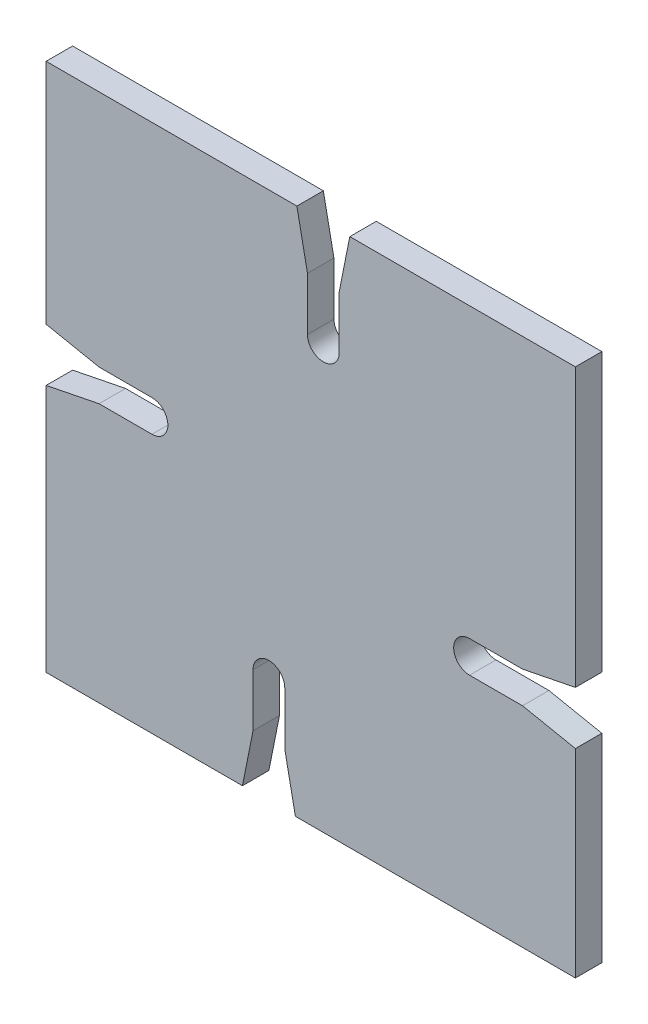
ISO-10303-21;
HEADER;
FILE_DESCRIPTION(('STEP AP214'),'2;1');
FILE_NAME('part.step','',(''),(''),'','','');
FILE_SCHEMA(('AUTOMOTIVE_DESIGN { 1 0 10303 214 1 1 1 1 }'));
ENDSEC;
DATA;
#1=APPLICATION_CONTEXT('core data for automotive mechanical design processes');
#2=APPLICATION_PROTOCOL_DEFINITION('international standard','automotive_design',2000,#1);
#3=PRODUCT_CONTEXT('',#1,'mechanical');
#4=PRODUCT('Part','Part','',(#3));
#5=PRODUCT_RELATED_PRODUCT_CATEGORY('part','',(#4));
#6=PRODUCT_DEFINITION_FORMATION('','',#4);
#7=PRODUCT_DEFINITION_CONTEXT('part definition',#1,'design');
#8=PRODUCT_DEFINITION('design','',#6,#7);
#9=PRODUCT_DEFINITION_SHAPE('','',#8);
#10=(LENGTH_UNIT() NAMED_UNIT(*) SI_UNIT(.MILLI.,.METRE.));
#11=(NAMED_UNIT(*) PLANE_ANGLE_UNIT() SI_UNIT($,.RADIAN.));
#12=(NAMED_UNIT(*) SI_UNIT($,.STERADIAN.) SOLID_ANGLE_UNIT());
#13=UNCERTAINTY_MEASURE_WITH_UNIT(LENGTH_MEASURE(1.E-05),#10,'distance_accuracy_value','');
#14=(GEOMETRIC_REPRESENTATION_CONTEXT(3) GLOBAL_UNCERTAINTY_ASSIGNED_CONTEXT((#13)) GLOBAL_UNIT_ASSIGNED_CONTEXT((#10,
#11,#12)) REPRESENTATION_CONTEXT('',''));
#15=CARTESIAN_POINT('',(0.,0.,0.));
#16=DIRECTION('',(0.,0.,1.));
#17=DIRECTION('',(1.,0.,0.));
#18=AXIS2_PLACEMENT_3D('',#15,#16,#17);
#19=CARTESIAN_POINT('',(100.,0.,5.));
#20=DIRECTION('',(-1.,0.,0.));
#21=DIRECTION('',(0.,0.,1.));
#22=AXIS2_PLACEMENT_3D('',#19,#20,#21);
#23=PLANE('',#22);
#24=DIRECTION('',(0.,1.,0.));
#25=VECTOR('',#24,1.);
#26=CARTESIAN_POINT('',(100.,0.,0.));
#27=LINE('',#26,#25);
#28=CARTESIAN_POINT('',(100.,0.,0.));
#29=VERTEX_POINT('',#28);
#30=CARTESIAN_POINT('',(100.,37.5450513889868,0.));
#31=VERTEX_POINT('',#30);
#32=EDGE_CURVE('E240',#29,#31,#27,.T.);
#33=ORIENTED_EDGE('',*,*,#32,.T.);
#34=DIRECTION('',(0.,0.,1.));
#35=VECTOR('',#34,1.);
#36=CARTESIAN_POINT('',(100.,37.5450513889868,-0.00100000000000013));
#37=LINE('',#36,#35);
#38=CARTESIAN_POINT('',(100.,37.5450513889868,5.));
#39=VERTEX_POINT('',#38);
#40=EDGE_CURVE('E221',#31,#39,#37,.T.);
#41=ORIENTED_EDGE('',*,*,#40,.T.);
#42=DIRECTION('',(0.,1.,0.));
#43=VECTOR('',#42,1.);
#44=CARTESIAN_POINT('',(100.,0.,5.));
#45=LINE('',#44,#43);
#46=CARTESIAN_POINT('',(100.,0.,5.));
#47=VERTEX_POINT('',#46);
#48=EDGE_CURVE('E407',#47,#39,#45,.T.);
#49=ORIENTED_EDGE('',*,*,#48,.F.);
#50=DIRECTION('',(0.,0.,-1.));
#51=VECTOR('',#50,1.);
#52=CARTESIAN_POINT('',(100.,0.,5.));
#53=LINE('',#52,#51);
#54=EDGE_CURVE('E45',#47,#29,#53,.T.);
#55=ORIENTED_EDGE('',*,*,#54,.T.);
#56=EDGE_LOOP('',(#33,#41,#49,#55));
#57=FACE_BOUND('',#56,.T.);
#58=ADVANCED_FACE('F37',(#57),#23,.F.);
#59=CARTESIAN_POINT('',(0.,100.,5.));
#60=DIRECTION('',(0.,-1.,0.));
#61=DIRECTION('',(0.,0.,-1.));
#62=AXIS2_PLACEMENT_3D('',#59,#60,#61);
#63=PLANE('',#62);
#64=DIRECTION('',(-1.,0.,0.));
#65=VECTOR('',#64,1.);
#66=CARTESIAN_POINT('',(0.,100.,0.));
#67=LINE('',#66,#65);
#68=CARTESIAN_POINT('',(100.,100.,0.));
#69=VERTEX_POINT('',#68);
#70=CARTESIAN_POINT('',(57.3775419070398,100.,0.));
#71=VERTEX_POINT('',#70);
#72=EDGE_CURVE('E250',#69,#71,#67,.T.);
#73=ORIENTED_EDGE('',*,*,#72,.T.);
#74=DIRECTION('',(0.,0.,1.));
#75=VECTOR('',#74,1.);
#76=CARTESIAN_POINT('',(57.3775419070398,100.,-0.00100000000000013));
#77=LINE('',#76,#75);
#78=CARTESIAN_POINT('',(57.3775419070398,100.,5.));
#79=VERTEX_POINT('',#78);
#80=EDGE_CURVE('E301',#71,#79,#77,.T.);
#81=ORIENTED_EDGE('',*,*,#80,.T.);
#82=DIRECTION('',(-1.,0.,0.));
#83=VECTOR('',#82,1.);
#84=CARTESIAN_POINT('',(0.,100.,5.));
#85=LINE('',#84,#83);
#86=CARTESIAN_POINT('',(100.,100.,5.));
#87=VERTEX_POINT('',#86);
#88=EDGE_CURVE('E262',#87,#79,#85,.T.);
#89=ORIENTED_EDGE('',*,*,#88,.F.);
#90=DIRECTION('',(0.,0.,-1.));
#91=VECTOR('',#90,1.);
#92=CARTESIAN_POINT('',(100.,100.,5.));
#93=LINE('',#92,#91);
#94=EDGE_CURVE('E261',#87,#69,#93,.T.);
#95=ORIENTED_EDGE('',*,*,#94,.T.);
#96=EDGE_LOOP('',(#73,#81,#89,#95));
#97=FACE_BOUND('',#96,.T.);
#98=ADVANCED_FACE('F268',(#97),#63,.F.);
#99=CARTESIAN_POINT('',(0.,0.,5.));
#100=DIRECTION('',(1.,0.,0.));
#101=DIRECTION('',(0.,0.,-1.));
#102=AXIS2_PLACEMENT_3D('',#99,#100,#101);
#103=PLANE('',#102);
#104=DIRECTION('',(0.,-1.,0.));
#105=VECTOR('',#104,1.);
#106=CARTESIAN_POINT('',(0.,0.,0.));
#107=LINE('',#106,#105);
#108=CARTESIAN_POINT('',(0.,100.,0.));
#109=VERTEX_POINT('',#108);
#110=CARTESIAN_POINT('',(0.,56.9667430656987,0.));
#111=VERTEX_POINT('',#110);
#112=EDGE_CURVE('E410',#109,#111,#107,.T.);
#113=ORIENTED_EDGE('',*,*,#112,.T.);
#114=DIRECTION('',(0.,0.,1.));
#115=VECTOR('',#114,1.);
#116=CARTESIAN_POINT('',(0.,56.9667430656987,-0.00100000000000013));
#117=LINE('',#116,#115);
#118=CARTESIAN_POINT('',(0.,56.9667430656987,5.));
#119=VERTEX_POINT('',#118);
#120=EDGE_CURVE('E341',#111,#119,#117,.T.);
#121=ORIENTED_EDGE('',*,*,#120,.T.);
#122=DIRECTION('',(0.,-1.,0.));
#123=VECTOR('',#122,1.);
#124=CARTESIAN_POINT('',(0.,0.,5.));
#125=LINE('',#124,#123);
#126=CARTESIAN_POINT('',(0.,100.,5.));
#127=VERTEX_POINT('',#126);
#128=EDGE_CURVE('E399',#127,#119,#125,.T.);
#129=ORIENTED_EDGE('',*,*,#128,.F.);
#130=DIRECTION('',(0.,0.,-1.));
#131=VECTOR('',#130,1.);
#132=CARTESIAN_POINT('',(0.,100.,5.));
#133=LINE('',#132,#131);
#134=EDGE_CURVE('E258',#127,#109,#133,.T.);
#135=ORIENTED_EDGE('',*,*,#134,.T.);
#136=EDGE_LOOP('',(#113,#121,#129,#135));
#137=FACE_BOUND('',#136,.T.);
#138=ADVANCED_FACE('F450',(#137),#103,.F.);
#139=CARTESIAN_POINT('',(0.,0.,5.));
#140=DIRECTION('',(0.,1.,0.));
#141=DIRECTION('',(0.,0.,1.));
#142=AXIS2_PLACEMENT_3D('',#139,#140,#141);
#143=PLANE('',#142);
#144=DIRECTION('',(1.,0.,0.));
#145=VECTOR('',#144,1.);
#146=CARTESIAN_POINT('',(0.,0.,0.));
#147=LINE('',#146,#145);
#148=CARTESIAN_POINT('',(0.,0.,0.));
#149=VERTEX_POINT('',#148);
#150=CARTESIAN_POINT('',(37.0907681686344,0.,0.));
#151=VERTEX_POINT('',#150);
#152=EDGE_CURVE('E252',#149,#151,#147,.T.);
#153=ORIENTED_EDGE('',*,*,#152,.T.);
#154=DIRECTION('',(0.,0.,1.));
#155=VECTOR('',#154,1.);
#156=CARTESIAN_POINT('',(37.0907681686344,0.,-0.00100000000000013));
#157=LINE('',#156,#155);
#158=CARTESIAN_POINT('',(37.0907681686344,0.,5.));
#159=VERTEX_POINT('',#158);
#160=EDGE_CURVE('E383',#151,#159,#157,.T.);
#161=ORIENTED_EDGE('',*,*,#160,.T.);
#162=DIRECTION('',(1.,0.,0.));
#163=VECTOR('',#162,1.);
#164=CARTESIAN_POINT('',(0.,0.,5.));
#165=LINE('',#164,#163);
#166=CARTESIAN_POINT('',(0.,0.,5.));
#167=VERTEX_POINT('',#166);
#168=EDGE_CURVE('E403',#167,#159,#165,.T.);
#169=ORIENTED_EDGE('',*,*,#168,.F.);
#170=DIRECTION('',(0.,0.,-1.));
#171=VECTOR('',#170,1.);
#172=CARTESIAN_POINT('',(0.,0.,5.));
#173=LINE('',#172,#171);
#174=EDGE_CURVE('E11',#167,#149,#173,.T.);
#175=ORIENTED_EDGE('',*,*,#174,.T.);
#176=EDGE_LOOP('',(#153,#161,#169,#175));
#177=FACE_BOUND('',#176,.T.);
#178=ADVANCED_FACE('F424',(#177),#143,.F.);
#179=CARTESIAN_POINT('',(0.,46.9667430656987,5.));
#180=VERTEX_POINT('',#179);
#181=EDGE_CURVE('E257',#180,#167,#125,.T.);
#182=ORIENTED_EDGE('',*,*,#181,.F.);
#183=DIRECTION('',(0.,0.,1.));
#184=VECTOR('',#183,1.);
#185=CARTESIAN_POINT('',(0.,46.9667430656987,-0.00100000000000013));
#186=LINE('',#185,#184);
#187=CARTESIAN_POINT('',(0.,46.9667430656987,0.));
#188=VERTEX_POINT('',#187);
#189=EDGE_CURVE('E340',#188,#180,#186,.T.);
#190=ORIENTED_EDGE('',*,*,#189,.F.);
#191=EDGE_CURVE('E398',#188,#149,#107,.T.);
#192=ORIENTED_EDGE('',*,*,#191,.T.);
#193=ORIENTED_EDGE('',*,*,#174,.F.);
#194=EDGE_LOOP('',(#182,#190,#192,#193));
#195=FACE_BOUND('',#194,.T.);
#196=ADVANCED_FACE('F39',(#195),#103,.F.);
#197=CARTESIAN_POINT('',(47.0907681686344,0.,5.));
#198=VERTEX_POINT('',#197);
#199=EDGE_CURVE('E402',#198,#47,#165,.T.);
#200=ORIENTED_EDGE('',*,*,#199,.F.);
#201=DIRECTION('',(0.,0.,1.));
#202=VECTOR('',#201,1.);
#203=CARTESIAN_POINT('',(47.0907681686344,0.,-0.00100000000000013));
#204=LINE('',#203,#202);
#205=CARTESIAN_POINT('',(47.0907681686344,0.,0.));
#206=VERTEX_POINT('',#205);
#207=EDGE_CURVE('E382',#206,#198,#204,.T.);
#208=ORIENTED_EDGE('',*,*,#207,.F.);
#209=EDGE_CURVE('E412',#206,#29,#147,.T.);
#210=ORIENTED_EDGE('',*,*,#209,.T.);
#211=ORIENTED_EDGE('',*,*,#54,.F.);
#212=EDGE_LOOP('',(#200,#208,#210,#211));
#213=FACE_BOUND('',#212,.T.);
#214=ADVANCED_FACE('F509',(#213),#143,.F.);
#215=CARTESIAN_POINT('',(100.,47.5450513889868,5.));
#216=VERTEX_POINT('',#215);
#217=EDGE_CURVE('E406',#216,#87,#45,.T.);
#218=ORIENTED_EDGE('',*,*,#217,.F.);
#219=DIRECTION('',(0.,0.,1.));
#220=VECTOR('',#219,1.);
#221=CARTESIAN_POINT('',(100.,47.5450513889868,-0.00100000000000013));
#222=LINE('',#221,#220);
#223=CARTESIAN_POINT('',(100.,47.5450513889868,0.));
#224=VERTEX_POINT('',#223);
#225=EDGE_CURVE('E469',#224,#216,#222,.T.);
#226=ORIENTED_EDGE('',*,*,#225,.F.);
#227=EDGE_CURVE('E248',#224,#69,#27,.T.);
#228=ORIENTED_EDGE('',*,*,#227,.T.);
#229=ORIENTED_EDGE('',*,*,#94,.F.);
#230=EDGE_LOOP('',(#218,#226,#228,#229));
#231=FACE_BOUND('',#230,.T.);
#232=ADVANCED_FACE('F536',(#231),#23,.F.);
#233=CARTESIAN_POINT('',(47.3775419070398,100.,5.));
#234=VERTEX_POINT('',#233);
#235=EDGE_CURVE('E409',#234,#127,#85,.T.);
#236=ORIENTED_EDGE('',*,*,#235,.F.);
#237=DIRECTION('',(0.,0.,1.));
#238=VECTOR('',#237,1.);
#239=CARTESIAN_POINT('',(47.3775419070398,100.,-0.00100000000000013));
#240=LINE('',#239,#238);
#241=CARTESIAN_POINT('',(47.3775419070398,100.,0.));
#242=VERTEX_POINT('',#241);
#243=EDGE_CURVE('E300',#242,#234,#240,.T.);
#244=ORIENTED_EDGE('',*,*,#243,.F.);
#245=EDGE_CURVE('E247',#242,#109,#67,.T.);
#246=ORIENTED_EDGE('',*,*,#245,.T.);
#247=ORIENTED_EDGE('',*,*,#134,.F.);
#248=EDGE_LOOP('',(#236,#244,#246,#247));
#249=FACE_BOUND('',#248,.T.);
#250=ADVANCED_FACE('F457',(#249),#63,.F.);
#251=CARTESIAN_POINT('',(0.,0.,5.));
#252=DIRECTION('',(0.,0.,-1.));
#253=DIRECTION('',(-1.,0.,0.));
#254=AXIS2_PLACEMENT_3D('',#251,#252,#253);
#255=PLANE('',#254);
#256=ORIENTED_EDGE('',*,*,#48,.T.);
#257=DIRECTION('',(0.98058067569092,-0.196116135138184,0.));
#258=VECTOR('',#257,1.);
#259=CARTESIAN_POINT('',(100.,37.5450513889868,5.));
#260=LINE('',#259,#258);
#261=CARTESIAN_POINT('',(90.,39.5450513889868,5.));
#262=VERTEX_POINT('',#261);
#263=EDGE_CURVE('E227',#262,#39,#260,.T.);
#264=ORIENTED_EDGE('',*,*,#263,.F.);
#265=DIRECTION('',(1.,0.,0.));
#266=VECTOR('',#265,1.);
#267=CARTESIAN_POINT('',(90.,39.5450513889868,5.));
#268=LINE('',#267,#266);
#269=CARTESIAN_POINT('',(80.,39.5450513889868,5.));
#270=VERTEX_POINT('',#269);
#271=EDGE_CURVE('E478',#270,#262,#268,.T.);
#272=ORIENTED_EDGE('',*,*,#271,.F.);
#273=CARTESIAN_POINT('',(80.,42.5450513889868,5.));
#274=DIRECTION('',(0.,0.,1.));
#275=DIRECTION('',(-1.,0.,0.));
#276=AXIS2_PLACEMENT_3D('',#273,#274,#275);
#277=CIRCLE('',#276,3.);
#278=CARTESIAN_POINT('',(80.,45.5450513889868,5.));
#279=VERTEX_POINT('',#278);
#280=EDGE_CURVE('E481',#279,#270,#277,.T.);
#281=ORIENTED_EDGE('',*,*,#280,.F.);
#282=DIRECTION('',(-1.,0.,0.));
#283=VECTOR('',#282,1.);
#284=CARTESIAN_POINT('',(80.,45.5450513889868,5.));
#285=LINE('',#284,#283);
#286=CARTESIAN_POINT('',(90.,45.5450513889868,5.));
#287=VERTEX_POINT('',#286);
#288=EDGE_CURVE('E484',#287,#279,#285,.T.);
#289=ORIENTED_EDGE('',*,*,#288,.F.);
#290=DIRECTION('',(-0.98058067569092,-0.196116135138184,0.));
#291=VECTOR('',#290,1.);
#292=CARTESIAN_POINT('',(90.,45.5450513889868,5.));
#293=LINE('',#292,#291);
#294=EDGE_CURVE('E243',#216,#287,#293,.T.);
#295=ORIENTED_EDGE('',*,*,#294,.F.);
#296=ORIENTED_EDGE('',*,*,#217,.T.);
#297=ORIENTED_EDGE('',*,*,#88,.T.);
#298=DIRECTION('',(0.196116135138184,0.98058067569092,0.));
#299=VECTOR('',#298,1.);
#300=CARTESIAN_POINT('',(57.3775419070398,100.,5.));
#301=LINE('',#300,#299);
#302=CARTESIAN_POINT('',(55.3775419070398,90.,5.));
#303=VERTEX_POINT('',#302);
#304=EDGE_CURVE('E298',#303,#79,#301,.T.);
#305=ORIENTED_EDGE('',*,*,#304,.F.);
#306=DIRECTION('',(0.,1.,0.));
#307=VECTOR('',#306,1.);
#308=CARTESIAN_POINT('',(55.3775419070398,90.,5.));
#309=LINE('',#308,#307);
#310=CARTESIAN_POINT('',(55.3775419070398,80.,5.));
#311=VERTEX_POINT('',#310);
#312=EDGE_CURVE('E295',#311,#303,#309,.T.);
#313=ORIENTED_EDGE('',*,*,#312,.F.);
#314=CARTESIAN_POINT('',(52.3775419070398,80.,5.));
#315=DIRECTION('',(0.,0.,1.));
#316=DIRECTION('',(-1.,0.,0.));
#317=AXIS2_PLACEMENT_3D('',#314,#315,#316);
#318=CIRCLE('',#317,3.);
#319=CARTESIAN_POINT('',(49.3775419070398,80.,5.));
#320=VERTEX_POINT('',#319);
#321=EDGE_CURVE('E292',#320,#311,#318,.T.);
#322=ORIENTED_EDGE('',*,*,#321,.F.);
#323=DIRECTION('',(0.,-1.,0.));
#324=VECTOR('',#323,1.);
#325=CARTESIAN_POINT('',(49.3775419070398,80.,5.));
#326=LINE('',#325,#324);
#327=CARTESIAN_POINT('',(49.3775419070398,90.,5.));
#328=VERTEX_POINT('',#327);
#329=EDGE_CURVE('E284',#328,#320,#326,.T.);
#330=ORIENTED_EDGE('',*,*,#329,.F.);
#331=DIRECTION('',(0.196116135138184,-0.98058067569092,0.));
#332=VECTOR('',#331,1.);
#333=CARTESIAN_POINT('',(49.3775419070398,90.,5.));
#334=LINE('',#333,#332);
#335=EDGE_CURVE('E282',#234,#328,#334,.T.);
#336=ORIENTED_EDGE('',*,*,#335,.F.);
#337=ORIENTED_EDGE('',*,*,#235,.T.);
#338=ORIENTED_EDGE('',*,*,#128,.T.);
#339=DIRECTION('',(-0.98058067569092,0.196116135138184,0.));
#340=VECTOR('',#339,1.);
#341=CARTESIAN_POINT('',(0.,56.9667430656987,5.));
#342=LINE('',#341,#340);
#343=CARTESIAN_POINT('',(10.,54.9667430656987,5.));
#344=VERTEX_POINT('',#343);
#345=EDGE_CURVE('E338',#344,#119,#342,.T.);
#346=ORIENTED_EDGE('',*,*,#345,.F.);
#347=DIRECTION('',(-1.,0.,0.));
#348=VECTOR('',#347,1.);
#349=CARTESIAN_POINT('',(10.,54.9667430656987,5.));
#350=LINE('',#349,#348);
#351=CARTESIAN_POINT('',(20.,54.9667430656987,5.));
#352=VERTEX_POINT('',#351);
#353=EDGE_CURVE('E335',#352,#344,#350,.T.);
#354=ORIENTED_EDGE('',*,*,#353,.F.);
#355=CARTESIAN_POINT('',(20.,51.9667430656987,5.));
#356=DIRECTION('',(0.,0.,1.));
#357=DIRECTION('',(-1.,0.,0.));
#358=AXIS2_PLACEMENT_3D('',#355,#356,#357);
#359=CIRCLE('',#358,3.);
#360=CARTESIAN_POINT('',(20.,48.9667430656987,5.));
#361=VERTEX_POINT('',#360);
#362=EDGE_CURVE('E332',#361,#352,#359,.T.);
#363=ORIENTED_EDGE('',*,*,#362,.F.);
#364=DIRECTION('',(1.,0.,0.));
#365=VECTOR('',#364,1.);
#366=CARTESIAN_POINT('',(20.,48.9667430656987,5.));
#367=LINE('',#366,#365);
#368=CARTESIAN_POINT('',(10.,48.9667430656987,5.));
#369=VERTEX_POINT('',#368);
#370=EDGE_CURVE('E329',#369,#361,#367,.T.);
#371=ORIENTED_EDGE('',*,*,#370,.F.);
#372=DIRECTION('',(0.98058067569092,0.196116135138185,0.));
#373=VECTOR('',#372,1.);
#374=CARTESIAN_POINT('',(10.,48.9667430656987,5.));
#375=LINE('',#374,#373);
#376=EDGE_CURVE('E326',#180,#369,#375,.T.);
#377=ORIENTED_EDGE('',*,*,#376,.F.);
#378=ORIENTED_EDGE('',*,*,#181,.T.);
#379=ORIENTED_EDGE('',*,*,#168,.T.);
#380=DIRECTION('',(-0.196116135138184,-0.98058067569092,0.));
#381=VECTOR('',#380,1.);
#382=CARTESIAN_POINT('',(37.0907681686344,0.,5.));
#383=LINE('',#382,#381);
#384=CARTESIAN_POINT('',(39.0907681686344,10.,5.));
#385=VERTEX_POINT('',#384);
#386=EDGE_CURVE('E380',#385,#159,#383,.T.);
#387=ORIENTED_EDGE('',*,*,#386,.F.);
#388=DIRECTION('',(0.,-1.,0.));
#389=VECTOR('',#388,1.);
#390=CARTESIAN_POINT('',(39.0907681686344,10.,5.));
#391=LINE('',#390,#389);
#392=CARTESIAN_POINT('',(39.0907681686344,20.,5.));
#393=VERTEX_POINT('',#392);
#394=EDGE_CURVE('E377',#393,#385,#391,.T.);
#395=ORIENTED_EDGE('',*,*,#394,.F.);
#396=CARTESIAN_POINT('',(42.0907681686344,20.,5.));
#397=DIRECTION('',(0.,0.,1.));
#398=DIRECTION('',(-1.,0.,0.));
#399=AXIS2_PLACEMENT_3D('',#396,#397,#398);
#400=CIRCLE('',#399,3.);
#401=CARTESIAN_POINT('',(45.0907681686344,20.,5.));
#402=VERTEX_POINT('',#401);
#403=EDGE_CURVE('E374',#402,#393,#400,.T.);
#404=ORIENTED_EDGE('',*,*,#403,.F.);
#405=DIRECTION('',(0.,1.,0.));
#406=VECTOR('',#405,1.);
#407=CARTESIAN_POINT('',(45.0907681686344,20.,5.));
#408=LINE('',#407,#406);
#409=CARTESIAN_POINT('',(45.0907681686344,10.,5.));
#410=VERTEX_POINT('',#409);
#411=EDGE_CURVE('E371',#410,#402,#408,.T.);
#412=ORIENTED_EDGE('',*,*,#411,.F.);
#413=DIRECTION('',(-0.196116135138185,0.98058067569092,0.));
#414=VECTOR('',#413,1.);
#415=CARTESIAN_POINT('',(45.0907681686344,10.,5.));
#416=LINE('',#415,#414);
#417=EDGE_CURVE('E368',#198,#410,#416,.T.);
#418=ORIENTED_EDGE('',*,*,#417,.F.);
#419=ORIENTED_EDGE('',*,*,#199,.T.);
#420=EDGE_LOOP('',(#256,#264,#272,#281,#289,#295,#296,#297,#305,#313,#322,#330,#336,#337,#338,
#346,#354,#363,#371,#377,#378,#379,#387,#395,#404,#412,#418,#419));
#421=FACE_BOUND('',#420,.T.);
#422=ADVANCED_FACE('F427',(#421),#255,.F.);
#423=CARTESIAN_POINT('',(0.,0.,0.));
#424=DIRECTION('',(0.,0.,-1.));
#425=DIRECTION('',(-1.,0.,0.));
#426=AXIS2_PLACEMENT_3D('',#423,#424,#425);
#427=PLANE('',#426);
#428=DIRECTION('',(0.98058067569092,-0.196116135138184,0.));
#429=VECTOR('',#428,1.);
#430=CARTESIAN_POINT('',(100.,37.5450513889868,0.));
#431=LINE('',#430,#429);
#432=CARTESIAN_POINT('',(90.,39.5450513889868,0.));
#433=VERTEX_POINT('',#432);
#434=EDGE_CURVE('E224',#433,#31,#431,.T.);
#435=ORIENTED_EDGE('',*,*,#434,.T.);
#436=ORIENTED_EDGE('',*,*,#32,.F.);
#437=ORIENTED_EDGE('',*,*,#209,.F.);
#438=DIRECTION('',(-0.196116135138185,0.98058067569092,0.));
#439=VECTOR('',#438,1.);
#440=CARTESIAN_POINT('',(45.0907681686344,10.,0.));
#441=LINE('',#440,#439);
#442=CARTESIAN_POINT('',(45.0907681686344,10.,0.));
#443=VERTEX_POINT('',#442);
#444=EDGE_CURVE('E386',#206,#443,#441,.T.);
#445=ORIENTED_EDGE('',*,*,#444,.T.);
#446=DIRECTION('',(0.,1.,0.));
#447=VECTOR('',#446,1.);
#448=CARTESIAN_POINT('',(45.0907681686344,20.,0.));
#449=LINE('',#448,#447);
#450=CARTESIAN_POINT('',(45.0907681686344,20.,0.));
#451=VERTEX_POINT('',#450);
#452=EDGE_CURVE('E356',#443,#451,#449,.T.);
#453=ORIENTED_EDGE('',*,*,#452,.T.);
#454=CARTESIAN_POINT('',(42.0907681686344,20.,0.));
#455=DIRECTION('',(0.,0.,-1.));
#456=DIRECTION('',(-1.,0.,0.));
#457=AXIS2_PLACEMENT_3D('',#454,#455,#456);
#458=CIRCLE('',#457,3.);
#459=CARTESIAN_POINT('',(39.0907681686344,20.,0.));
#460=VERTEX_POINT('',#459);
#461=EDGE_CURVE('E359',#451,#460,#458,.F.);
#462=ORIENTED_EDGE('',*,*,#461,.T.);
#463=DIRECTION('',(0.,-1.,0.));
#464=VECTOR('',#463,1.);
#465=CARTESIAN_POINT('',(39.0907681686344,10.,0.));
#466=LINE('',#465,#464);
#467=CARTESIAN_POINT('',(39.0907681686344,10.,0.));
#468=VERTEX_POINT('',#467);
#469=EDGE_CURVE('E362',#460,#468,#466,.T.);
#470=ORIENTED_EDGE('',*,*,#469,.T.);
#471=DIRECTION('',(-0.196116135138184,-0.98058067569092,0.));
#472=VECTOR('',#471,1.);
#473=CARTESIAN_POINT('',(37.0907681686344,0.,0.));
#474=LINE('',#473,#472);
#475=EDGE_CURVE('E365',#468,#151,#474,.T.);
#476=ORIENTED_EDGE('',*,*,#475,.T.);
#477=ORIENTED_EDGE('',*,*,#152,.F.);
#478=ORIENTED_EDGE('',*,*,#191,.F.);
#479=DIRECTION('',(0.98058067569092,0.196116135138185,0.));
#480=VECTOR('',#479,1.);
#481=CARTESIAN_POINT('',(10.,48.9667430656987,0.));
#482=LINE('',#481,#480);
#483=CARTESIAN_POINT('',(10.,48.9667430656987,0.));
#484=VERTEX_POINT('',#483);
#485=EDGE_CURVE('E344',#188,#484,#482,.T.);
#486=ORIENTED_EDGE('',*,*,#485,.T.);
#487=DIRECTION('',(1.,0.,0.));
#488=VECTOR('',#487,1.);
#489=CARTESIAN_POINT('',(20.,48.9667430656987,0.));
#490=LINE('',#489,#488);
#491=CARTESIAN_POINT('',(20.,48.9667430656987,0.));
#492=VERTEX_POINT('',#491);
#493=EDGE_CURVE('E314',#484,#492,#490,.T.);
#494=ORIENTED_EDGE('',*,*,#493,.T.);
#495=CARTESIAN_POINT('',(20.,51.9667430656987,0.));
#496=DIRECTION('',(0.,0.,-1.));
#497=DIRECTION('',(-1.,0.,0.));
#498=AXIS2_PLACEMENT_3D('',#495,#496,#497);
#499=CIRCLE('',#498,3.);
#500=CARTESIAN_POINT('',(20.,54.9667430656987,0.));
#501=VERTEX_POINT('',#500);
#502=EDGE_CURVE('E317',#492,#501,#499,.F.);
#503=ORIENTED_EDGE('',*,*,#502,.T.);
#504=DIRECTION('',(-1.,0.,0.));
#505=VECTOR('',#504,1.);
#506=CARTESIAN_POINT('',(10.,54.9667430656987,0.));
#507=LINE('',#506,#505);
#508=CARTESIAN_POINT('',(10.,54.9667430656987,0.));
#509=VERTEX_POINT('',#508);
#510=EDGE_CURVE('E320',#501,#509,#507,.T.);
#511=ORIENTED_EDGE('',*,*,#510,.T.);
#512=DIRECTION('',(-0.98058067569092,0.196116135138184,0.));
#513=VECTOR('',#512,1.);
#514=CARTESIAN_POINT('',(0.,56.9667430656987,0.));
#515=LINE('',#514,#513);
#516=EDGE_CURVE('E323',#509,#111,#515,.T.);
#517=ORIENTED_EDGE('',*,*,#516,.T.);
#518=ORIENTED_EDGE('',*,*,#112,.F.);
#519=ORIENTED_EDGE('',*,*,#245,.F.);
#520=DIRECTION('',(0.196116135138184,-0.98058067569092,0.));
#521=VECTOR('',#520,1.);
#522=CARTESIAN_POINT('',(49.3775419070398,90.,0.));
#523=LINE('',#522,#521);
#524=CARTESIAN_POINT('',(49.3775419070398,90.,0.));
#525=VERTEX_POINT('',#524);
#526=EDGE_CURVE('E303',#242,#525,#523,.T.);
#527=ORIENTED_EDGE('',*,*,#526,.T.);
#528=DIRECTION('',(0.,-1.,0.));
#529=VECTOR('',#528,1.);
#530=CARTESIAN_POINT('',(49.3775419070398,80.,0.));
#531=LINE('',#530,#529);
#532=CARTESIAN_POINT('',(49.3775419070398,80.,0.));
#533=VERTEX_POINT('',#532);
#534=EDGE_CURVE('E459',#525,#533,#531,.T.);
#535=ORIENTED_EDGE('',*,*,#534,.T.);
#536=CARTESIAN_POINT('',(52.3775419070398,80.,0.));
#537=DIRECTION('',(0.,0.,-1.));
#538=DIRECTION('',(-1.,0.,0.));
#539=AXIS2_PLACEMENT_3D('',#536,#537,#538);
#540=CIRCLE('',#539,3.);
#541=CARTESIAN_POINT('',(55.3775419070398,80.,0.));
#542=VERTEX_POINT('',#541);
#543=EDGE_CURVE('E286',#533,#542,#540,.F.);
#544=ORIENTED_EDGE('',*,*,#543,.T.);
#545=DIRECTION('',(0.,1.,0.));
#546=VECTOR('',#545,1.);
#547=CARTESIAN_POINT('',(55.3775419070398,90.,0.));
#548=LINE('',#547,#546);
#549=CARTESIAN_POINT('',(55.3775419070398,90.,0.));
#550=VERTEX_POINT('',#549);
#551=EDGE_CURVE('E279',#542,#550,#548,.T.);
#552=ORIENTED_EDGE('',*,*,#551,.T.);
#553=DIRECTION('',(0.196116135138184,0.98058067569092,0.));
#554=VECTOR('',#553,1.);
#555=CARTESIAN_POINT('',(57.3775419070398,100.,0.));
#556=LINE('',#555,#554);
#557=EDGE_CURVE('E277',#550,#71,#556,.T.);
#558=ORIENTED_EDGE('',*,*,#557,.T.);
#559=ORIENTED_EDGE('',*,*,#72,.F.);
#560=ORIENTED_EDGE('',*,*,#227,.F.);
#561=DIRECTION('',(-0.98058067569092,-0.196116135138184,0.));
#562=VECTOR('',#561,1.);
#563=CARTESIAN_POINT('',(90.,45.5450513889868,0.));
#564=LINE('',#563,#562);
#565=CARTESIAN_POINT('',(90.,45.5450513889868,0.));
#566=VERTEX_POINT('',#565);
#567=EDGE_CURVE('E232',#224,#566,#564,.T.);
#568=ORIENTED_EDGE('',*,*,#567,.T.);
#569=DIRECTION('',(-1.,0.,0.));
#570=VECTOR('',#569,1.);
#571=CARTESIAN_POINT('',(80.,45.5450513889868,0.));
#572=LINE('',#571,#570);
#573=CARTESIAN_POINT('',(80.,45.5450513889868,0.));
#574=VERTEX_POINT('',#573);
#575=EDGE_CURVE('E491',#566,#574,#572,.T.);
#576=ORIENTED_EDGE('',*,*,#575,.T.);
#577=CARTESIAN_POINT('',(80.,42.5450513889868,0.));
#578=DIRECTION('',(0.,0.,-1.));
#579=DIRECTION('',(-1.,0.,0.));
#580=AXIS2_PLACEMENT_3D('',#577,#578,#579);
#581=CIRCLE('',#580,3.);
#582=CARTESIAN_POINT('',(80.,39.5450513889868,0.));
#583=VERTEX_POINT('',#582);
#584=EDGE_CURVE('E489',#574,#583,#581,.F.);
#585=ORIENTED_EDGE('',*,*,#584,.T.);
#586=DIRECTION('',(1.,0.,0.));
#587=VECTOR('',#586,1.);
#588=CARTESIAN_POINT('',(90.,39.5450513889868,0.));
#589=LINE('',#588,#587);
#590=EDGE_CURVE('E242',#583,#433,#589,.T.);
#591=ORIENTED_EDGE('',*,*,#590,.T.);
#592=EDGE_LOOP('',(#435,#436,#437,#445,#453,#462,#470,#476,#477,#478,#486,#494,#503,#511,#517,
#518,#519,#527,#535,#544,#552,#558,#559,#560,#568,#576,#585,#591));
#593=FACE_BOUND('',#592,.T.);
#594=ADVANCED_FACE('F238',(#593),#427,.T.);
#595=CARTESIAN_POINT('',(37.0907681686344,0.,-0.00100000000000013));
#596=DIRECTION('',(-0.98058067569092,0.196116135138184,0.));
#597=DIRECTION('',(-0.196116135138184,-0.98058067569092,0.));
#598=AXIS2_PLACEMENT_3D('',#595,#596,#597);
#599=PLANE('',#598);
#600=DIRECTION('',(0.,0.,1.));
#601=VECTOR('',#600,1.);
#602=CARTESIAN_POINT('',(39.0907681686344,10.,-0.00100000000000013));
#603=LINE('',#602,#601);
#604=EDGE_CURVE('E387',#468,#385,#603,.T.);
#605=ORIENTED_EDGE('',*,*,#604,.T.);
#606=ORIENTED_EDGE('',*,*,#386,.T.);
#607=ORIENTED_EDGE('',*,*,#160,.F.);
#608=ORIENTED_EDGE('',*,*,#475,.F.);
#609=EDGE_LOOP('',(#605,#606,#607,#608));
#610=FACE_BOUND('',#609,.T.);
#611=ADVANCED_FACE('F524',(#610),#599,.F.);
#612=CARTESIAN_POINT('',(39.0907681686344,10.,-0.00100000000000013));
#613=DIRECTION('',(-1.,0.,0.));
#614=DIRECTION('',(0.,0.,1.));
#615=AXIS2_PLACEMENT_3D('',#612,#613,#614);
#616=PLANE('',#615);
#617=DIRECTION('',(0.,0.,1.));
#618=VECTOR('',#617,1.);
#619=CARTESIAN_POINT('',(39.0907681686344,20.,-0.00100000000000013));
#620=LINE('',#619,#618);
#621=EDGE_CURVE('E389',#460,#393,#620,.T.);
#622=ORIENTED_EDGE('',*,*,#621,.T.);
#623=ORIENTED_EDGE('',*,*,#394,.T.);
#624=ORIENTED_EDGE('',*,*,#604,.F.);
#625=ORIENTED_EDGE('',*,*,#469,.F.);
#626=EDGE_LOOP('',(#622,#623,#624,#625));
#627=FACE_BOUND('',#626,.T.);
#628=ADVANCED_FACE('F522',(#627),#616,.F.);
#629=CARTESIAN_POINT('',(42.0907681686344,20.,-0.00100000000000013));
#630=DIRECTION('',(0.,0.,1.));
#631=DIRECTION('',(1.,0.,0.));
#632=AXIS2_PLACEMENT_3D('',#629,#630,#631);
#633=CYLINDRICAL_SURFACE('',#632,3.);
#634=DIRECTION('',(0.,0.,1.));
#635=VECTOR('',#634,1.);
#636=CARTESIAN_POINT('',(45.0907681686344,20.,-0.00100000000000013));
#637=LINE('',#636,#635);
#638=EDGE_CURVE('E391',#451,#402,#637,.T.);
#639=ORIENTED_EDGE('',*,*,#638,.T.);
#640=ORIENTED_EDGE('',*,*,#403,.T.);
#641=ORIENTED_EDGE('',*,*,#621,.F.);
#642=ORIENTED_EDGE('',*,*,#461,.F.);
#643=EDGE_LOOP('',(#639,#640,#641,#642));
#644=FACE_BOUND('',#643,.T.);
#645=ADVANCED_FACE('F518',(#644),#633,.F.);
#646=CARTESIAN_POINT('',(45.0907681686344,20.,-0.00100000000000013));
#647=DIRECTION('',(1.,0.,0.));
#648=DIRECTION('',(0.,0.,-1.));
#649=AXIS2_PLACEMENT_3D('',#646,#647,#648);
#650=PLANE('',#649);
#651=DIRECTION('',(0.,0.,1.));
#652=VECTOR('',#651,1.);
#653=CARTESIAN_POINT('',(45.0907681686344,10.,-0.00100000000000013));
#654=LINE('',#653,#652);
#655=EDGE_CURVE('E393',#443,#410,#654,.T.);
#656=ORIENTED_EDGE('',*,*,#655,.T.);
#657=ORIENTED_EDGE('',*,*,#411,.T.);
#658=ORIENTED_EDGE('',*,*,#638,.F.);
#659=ORIENTED_EDGE('',*,*,#452,.F.);
#660=EDGE_LOOP('',(#656,#657,#658,#659));
#661=FACE_BOUND('',#660,.T.);
#662=ADVANCED_FACE('F515',(#661),#650,.F.);
#663=CARTESIAN_POINT('',(45.0907681686344,10.,-0.00100000000000013));
#664=DIRECTION('',(0.98058067569092,0.196116135138185,0.));
#665=DIRECTION('',(-0.196116135138185,0.98058067569092,0.));
#666=AXIS2_PLACEMENT_3D('',#663,#664,#665);
#667=PLANE('',#666);
#668=ORIENTED_EDGE('',*,*,#207,.T.);
#669=ORIENTED_EDGE('',*,*,#417,.T.);
#670=ORIENTED_EDGE('',*,*,#655,.F.);
#671=ORIENTED_EDGE('',*,*,#444,.F.);
#672=EDGE_LOOP('',(#668,#669,#670,#671));
#673=FACE_BOUND('',#672,.T.);
#674=ADVANCED_FACE('F512',(#673),#667,.F.);
#675=CARTESIAN_POINT('',(0.,56.9667430656987,-0.00100000000000013));
#676=DIRECTION('',(0.196116135138184,0.98058067569092,0.));
#677=DIRECTION('',(-0.98058067569092,0.196116135138184,0.));
#678=AXIS2_PLACEMENT_3D('',#675,#676,#677);
#679=PLANE('',#678);
#680=DIRECTION('',(0.,0.,1.));
#681=VECTOR('',#680,1.);
#682=CARTESIAN_POINT('',(10.,54.9667430656987,-0.00100000000000013));
#683=LINE('',#682,#681);
#684=EDGE_CURVE('E345',#509,#344,#683,.T.);
#685=ORIENTED_EDGE('',*,*,#684,.T.);
#686=ORIENTED_EDGE('',*,*,#345,.T.);
#687=ORIENTED_EDGE('',*,*,#120,.F.);
#688=ORIENTED_EDGE('',*,*,#516,.F.);
#689=EDGE_LOOP('',(#685,#686,#687,#688));
#690=FACE_BOUND('',#689,.T.);
#691=ADVANCED_FACE('F448',(#690),#679,.F.);
#692=CARTESIAN_POINT('',(10.,54.9667430656987,-0.00100000000000013));
#693=DIRECTION('',(0.,1.,0.));
#694=DIRECTION('',(0.,0.,1.));
#695=AXIS2_PLACEMENT_3D('',#692,#693,#694);
#696=PLANE('',#695);
#697=DIRECTION('',(0.,0.,1.));
#698=VECTOR('',#697,1.);
#699=CARTESIAN_POINT('',(20.,54.9667430656987,-0.00100000000000013));
#700=LINE('',#699,#698);
#701=EDGE_CURVE('E347',#501,#352,#700,.T.);
#702=ORIENTED_EDGE('',*,*,#701,.T.);
#703=ORIENTED_EDGE('',*,*,#353,.T.);
#704=ORIENTED_EDGE('',*,*,#684,.F.);
#705=ORIENTED_EDGE('',*,*,#510,.F.);
#706=EDGE_LOOP('',(#702,#703,#704,#705));
#707=FACE_BOUND('',#706,.T.);
#708=ADVANCED_FACE('F443',(#707),#696,.F.);
#709=CARTESIAN_POINT('',(20.,51.9667430656987,-0.00100000000000013));
#710=DIRECTION('',(0.,0.,1.));
#711=DIRECTION('',(1.,0.,0.));
#712=AXIS2_PLACEMENT_3D('',#709,#710,#711);
#713=CYLINDRICAL_SURFACE('',#712,3.);
#714=DIRECTION('',(0.,0.,1.));
#715=VECTOR('',#714,1.);
#716=CARTESIAN_POINT('',(20.,48.9667430656987,-0.00100000000000013));
#717=LINE('',#716,#715);
#718=EDGE_CURVE('E349',#492,#361,#717,.T.);
#719=ORIENTED_EDGE('',*,*,#718,.T.);
#720=ORIENTED_EDGE('',*,*,#362,.T.);
#721=ORIENTED_EDGE('',*,*,#701,.F.);
#722=ORIENTED_EDGE('',*,*,#502,.F.);
#723=EDGE_LOOP('',(#719,#720,#721,#722));
#724=FACE_BOUND('',#723,.T.);
#725=ADVANCED_FACE('F439',(#724),#713,.F.);
#726=CARTESIAN_POINT('',(20.,48.9667430656987,-0.00100000000000013));
#727=DIRECTION('',(0.,-1.,0.));
#728=DIRECTION('',(0.,0.,-1.));
#729=AXIS2_PLACEMENT_3D('',#726,#727,#728);
#730=PLANE('',#729);
#731=DIRECTION('',(0.,0.,1.));
#732=VECTOR('',#731,1.);
#733=CARTESIAN_POINT('',(10.,48.9667430656987,-0.00100000000000013));
#734=LINE('',#733,#732);
#735=EDGE_CURVE('E351',#484,#369,#734,.T.);
#736=ORIENTED_EDGE('',*,*,#735,.T.);
#737=ORIENTED_EDGE('',*,*,#370,.T.);
#738=ORIENTED_EDGE('',*,*,#718,.F.);
#739=ORIENTED_EDGE('',*,*,#493,.F.);
#740=EDGE_LOOP('',(#736,#737,#738,#739));
#741=FACE_BOUND('',#740,.T.);
#742=ADVANCED_FACE('F437',(#741),#730,.F.);
#743=CARTESIAN_POINT('',(10.,48.9667430656987,-0.00100000000000013));
#744=DIRECTION('',(0.196116135138185,-0.98058067569092,0.));
#745=DIRECTION('',(0.98058067569092,0.196116135138185,0.));
#746=AXIS2_PLACEMENT_3D('',#743,#744,#745);
#747=PLANE('',#746);
#748=ORIENTED_EDGE('',*,*,#189,.T.);
#749=ORIENTED_EDGE('',*,*,#376,.T.);
#750=ORIENTED_EDGE('',*,*,#735,.F.);
#751=ORIENTED_EDGE('',*,*,#485,.F.);
#752=EDGE_LOOP('',(#748,#749,#750,#751));
#753=FACE_BOUND('',#752,.T.);
#754=ADVANCED_FACE('F433',(#753),#747,.F.);
#755=CARTESIAN_POINT('',(57.3775419070398,100.,-0.00100000000000013));
#756=DIRECTION('',(0.98058067569092,-0.196116135138184,0.));
#757=DIRECTION('',(0.196116135138184,0.98058067569092,0.));
#758=AXIS2_PLACEMENT_3D('',#755,#756,#757);
#759=PLANE('',#758);
#760=DIRECTION('',(0.,0.,1.));
#761=VECTOR('',#760,1.);
#762=CARTESIAN_POINT('',(55.3775419070398,90.,-0.00100000000000013));
#763=LINE('',#762,#761);
#764=EDGE_CURVE('E304',#550,#303,#763,.T.);
#765=ORIENTED_EDGE('',*,*,#764,.T.);
#766=ORIENTED_EDGE('',*,*,#304,.T.);
#767=ORIENTED_EDGE('',*,*,#80,.F.);
#768=ORIENTED_EDGE('',*,*,#557,.F.);
#769=EDGE_LOOP('',(#765,#766,#767,#768));
#770=FACE_BOUND('',#769,.T.);
#771=ADVANCED_FACE('F558',(#770),#759,.F.);
#772=CARTESIAN_POINT('',(55.3775419070398,90.,-0.00100000000000013));
#773=DIRECTION('',(1.,0.,0.));
#774=DIRECTION('',(0.,1.,0.));
#775=AXIS2_PLACEMENT_3D('',#772,#773,#774);
#776=PLANE('',#775);
#777=DIRECTION('',(0.,0.,1.));
#778=VECTOR('',#777,1.);
#779=CARTESIAN_POINT('',(55.3775419070398,80.,-0.00100000000000013));
#780=LINE('',#779,#778);
#781=EDGE_CURVE('E306',#542,#311,#780,.T.);
#782=ORIENTED_EDGE('',*,*,#781,.T.);
#783=ORIENTED_EDGE('',*,*,#312,.T.);
#784=ORIENTED_EDGE('',*,*,#764,.F.);
#785=ORIENTED_EDGE('',*,*,#551,.F.);
#786=EDGE_LOOP('',(#782,#783,#784,#785));
#787=FACE_BOUND('',#786,.T.);
#788=ADVANCED_FACE('F561',(#787),#776,.F.);
#789=CARTESIAN_POINT('',(52.3775419070398,80.,-0.00100000000000013));
#790=DIRECTION('',(0.,0.,1.));
#791=DIRECTION('',(1.,0.,0.));
#792=AXIS2_PLACEMENT_3D('',#789,#790,#791);
#793=CYLINDRICAL_SURFACE('',#792,3.);
#794=DIRECTION('',(0.,0.,1.));
#795=VECTOR('',#794,1.);
#796=CARTESIAN_POINT('',(49.3775419070398,80.,-0.00100000000000013));
#797=LINE('',#796,#795);
#798=EDGE_CURVE('E308',#533,#320,#797,.T.);
#799=ORIENTED_EDGE('',*,*,#798,.T.);
#800=ORIENTED_EDGE('',*,*,#321,.T.);
#801=ORIENTED_EDGE('',*,*,#781,.F.);
#802=ORIENTED_EDGE('',*,*,#543,.F.);
#803=EDGE_LOOP('',(#799,#800,#801,#802));
#804=FACE_BOUND('',#803,.T.);
#805=ADVANCED_FACE('F564',(#804),#793,.F.);
#806=CARTESIAN_POINT('',(49.3775419070398,80.,-0.00100000000000013));
#807=DIRECTION('',(-1.,0.,0.));
#808=DIRECTION('',(0.,0.,1.));
#809=AXIS2_PLACEMENT_3D('',#806,#807,#808);
#810=PLANE('',#809);
#811=DIRECTION('',(0.,0.,1.));
#812=VECTOR('',#811,1.);
#813=CARTESIAN_POINT('',(49.3775419070398,90.,-0.00100000000000013));
#814=LINE('',#813,#812);
#815=EDGE_CURVE('E60',#525,#328,#814,.T.);
#816=ORIENTED_EDGE('',*,*,#815,.T.);
#817=ORIENTED_EDGE('',*,*,#329,.T.);
#818=ORIENTED_EDGE('',*,*,#798,.F.);
#819=ORIENTED_EDGE('',*,*,#534,.F.);
#820=EDGE_LOOP('',(#816,#817,#818,#819));
#821=FACE_BOUND('',#820,.T.);
#822=ADVANCED_FACE('F465',(#821),#810,.F.);
#823=CARTESIAN_POINT('',(49.3775419070398,90.,-0.00100000000000013));
#824=DIRECTION('',(-0.98058067569092,-0.196116135138184,0.));
#825=DIRECTION('',(0.196116135138184,-0.98058067569092,0.));
#826=AXIS2_PLACEMENT_3D('',#823,#824,#825);
#827=PLANE('',#826);
#828=ORIENTED_EDGE('',*,*,#243,.T.);
#829=ORIENTED_EDGE('',*,*,#335,.T.);
#830=ORIENTED_EDGE('',*,*,#815,.F.);
#831=ORIENTED_EDGE('',*,*,#526,.F.);
#832=EDGE_LOOP('',(#828,#829,#830,#831));
#833=FACE_BOUND('',#832,.T.);
#834=ADVANCED_FACE('F460',(#833),#827,.F.);
#835=CARTESIAN_POINT('',(100.,37.5450513889868,-0.00100000000000013));
#836=DIRECTION('',(-0.196116135138184,-0.98058067569092,0.));
#837=DIRECTION('',(0.98058067569092,-0.196116135138184,0.));
#838=AXIS2_PLACEMENT_3D('',#835,#836,#837);
#839=PLANE('',#838);
#840=DIRECTION('',(0.,0.,1.));
#841=VECTOR('',#840,1.);
#842=CARTESIAN_POINT('',(90.,39.5450513889868,-0.00100000000000013));
#843=LINE('',#842,#841);
#844=EDGE_CURVE('E233',#433,#262,#843,.T.);
#845=ORIENTED_EDGE('',*,*,#844,.T.);
#846=ORIENTED_EDGE('',*,*,#263,.T.);
#847=ORIENTED_EDGE('',*,*,#40,.F.);
#848=ORIENTED_EDGE('',*,*,#434,.F.);
#849=EDGE_LOOP('',(#845,#846,#847,#848));
#850=FACE_BOUND('',#849,.T.);
#851=ADVANCED_FACE('F223',(#850),#839,.F.);
#852=CARTESIAN_POINT('',(90.,39.5450513889868,-0.00100000000000013));
#853=DIRECTION('',(0.,-1.,0.));
#854=DIRECTION('',(0.,0.,-1.));
#855=AXIS2_PLACEMENT_3D('',#852,#853,#854);
#856=PLANE('',#855);
#857=DIRECTION('',(0.,0.,1.));
#858=VECTOR('',#857,1.);
#859=CARTESIAN_POINT('',(80.,39.5450513889868,-0.00100000000000013));
#860=LINE('',#859,#858);
#861=EDGE_CURVE('E474',#583,#270,#860,.T.);
#862=ORIENTED_EDGE('',*,*,#861,.T.);
#863=ORIENTED_EDGE('',*,*,#271,.T.);
#864=ORIENTED_EDGE('',*,*,#844,.F.);
#865=ORIENTED_EDGE('',*,*,#590,.F.);
#866=EDGE_LOOP('',(#862,#863,#864,#865));
#867=FACE_BOUND('',#866,.T.);
#868=ADVANCED_FACE('F503',(#867),#856,.F.);
#869=CARTESIAN_POINT('',(80.,42.5450513889868,-0.00100000000000013));
#870=DIRECTION('',(0.,0.,1.));
#871=DIRECTION('',(1.,0.,0.));
#872=AXIS2_PLACEMENT_3D('',#869,#870,#871);
#873=CYLINDRICAL_SURFACE('',#872,3.);
#874=DIRECTION('',(0.,0.,1.));
#875=VECTOR('',#874,1.);
#876=CARTESIAN_POINT('',(80.,45.5450513889868,-0.00100000000000013));
#877=LINE('',#876,#875);
#878=EDGE_CURVE('E472',#574,#279,#877,.T.);
#879=ORIENTED_EDGE('',*,*,#878,.T.);
#880=ORIENTED_EDGE('',*,*,#280,.T.);
#881=ORIENTED_EDGE('',*,*,#861,.F.);
#882=ORIENTED_EDGE('',*,*,#584,.F.);
#883=EDGE_LOOP('',(#879,#880,#881,#882));
#884=FACE_BOUND('',#883,.T.);
#885=ADVANCED_FACE('F499',(#884),#873,.F.);
#886=CARTESIAN_POINT('',(80.,45.5450513889868,-0.00100000000000013));
#887=DIRECTION('',(0.,1.,0.));
#888=DIRECTION('',(0.,0.,1.));
#889=AXIS2_PLACEMENT_3D('',#886,#887,#888);
#890=PLANE('',#889);
#891=DIRECTION('',(0.,0.,1.));
#892=VECTOR('',#891,1.);
#893=CARTESIAN_POINT('',(90.,45.5450513889868,-0.00100000000000013));
#894=LINE('',#893,#892);
#895=EDGE_CURVE('E52',#566,#287,#894,.T.);
#896=ORIENTED_EDGE('',*,*,#895,.T.);
#897=ORIENTED_EDGE('',*,*,#288,.T.);
#898=ORIENTED_EDGE('',*,*,#878,.F.);
#899=ORIENTED_EDGE('',*,*,#575,.F.);
#900=EDGE_LOOP('',(#896,#897,#898,#899));
#901=FACE_BOUND('',#900,.T.);
#902=ADVANCED_FACE('F495',(#901),#890,.F.);
#903=CARTESIAN_POINT('',(90.,45.5450513889868,-0.00100000000000013));
#904=DIRECTION('',(-0.196116135138184,0.98058067569092,0.));
#905=DIRECTION('',(-0.98058067569092,-0.196116135138184,0.));
#906=AXIS2_PLACEMENT_3D('',#903,#904,#905);
#907=PLANE('',#906);
#908=ORIENTED_EDGE('',*,*,#225,.T.);
#909=ORIENTED_EDGE('',*,*,#294,.T.);
#910=ORIENTED_EDGE('',*,*,#895,.F.);
#911=ORIENTED_EDGE('',*,*,#567,.F.);
#912=EDGE_LOOP('',(#908,#909,#910,#911));
#913=FACE_BOUND('',#912,.T.);
#914=ADVANCED_FACE('F549',(#913),#907,.F.);
#915=CLOSED_SHELL('',(#58,#98,#138,#178,#196,#214,#232,#250,#422,#594,#611,#628,#645,#662,#674,
#691,#708,#725,#742,#754,#771,#788,#805,#822,#834,#851,#868,#885,#902,#914));
#916=MANIFOLD_SOLID_BREP('B2',#915);
#917=ADVANCED_BREP_SHAPE_REPRESENTATION('',(#18,#916),#14);
#918=SHAPE_DEFINITION_REPRESENTATION(#9,#917);
ENDSEC;
END-ISO-10303-21;
